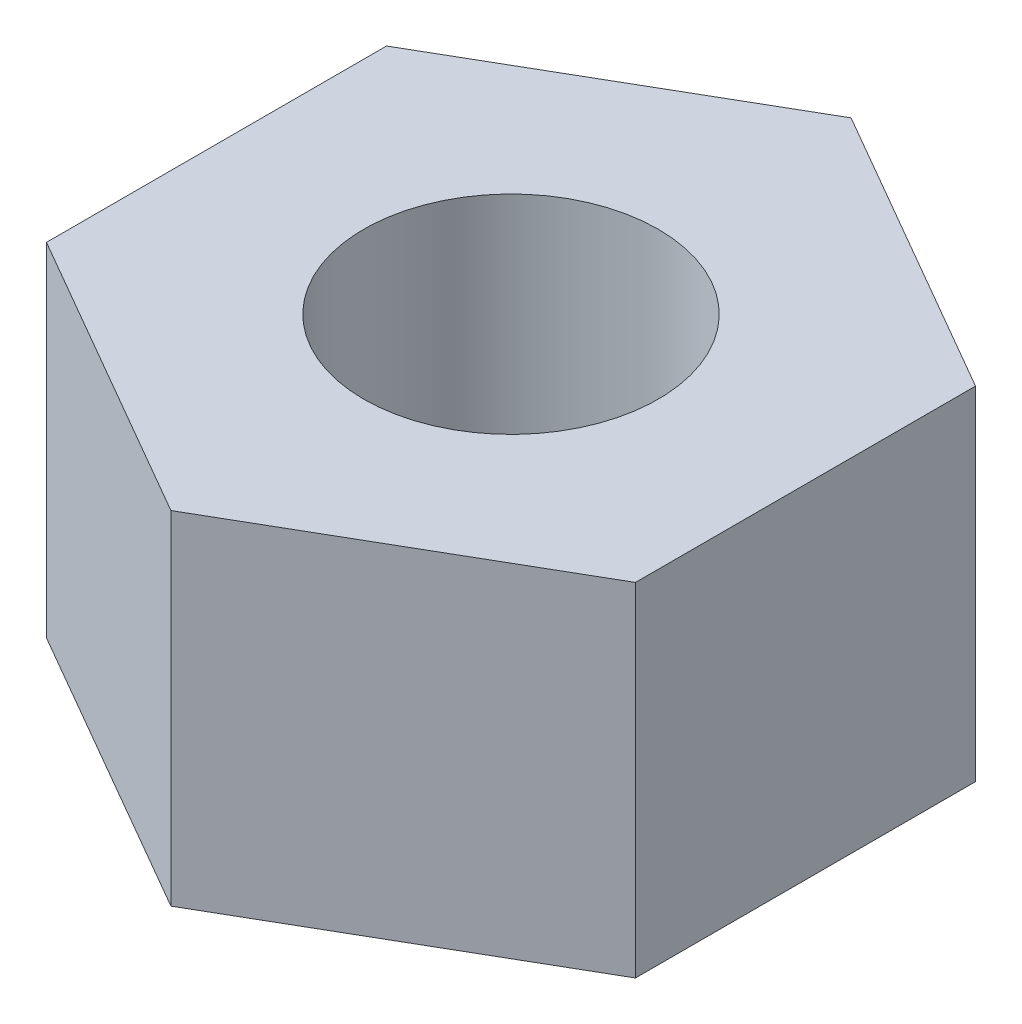
ISO-10303-21;
HEADER;
FILE_DESCRIPTION(('STEP AP214'),'2;1');
FILE_NAME('part.step','',(''),(''),'','','');
FILE_SCHEMA(('AUTOMOTIVE_DESIGN { 1 0 10303 214 1 1 1 1 }'));
ENDSEC;
DATA;
#1=APPLICATION_CONTEXT('core data for automotive mechanical design processes');
#2=APPLICATION_PROTOCOL_DEFINITION('international standard','automotive_design',2000,#1);
#3=PRODUCT_CONTEXT('',#1,'mechanical');
#4=PRODUCT('Part','Part','',(#3));
#5=PRODUCT_RELATED_PRODUCT_CATEGORY('part','',(#4));
#6=PRODUCT_DEFINITION_FORMATION('','',#4);
#7=PRODUCT_DEFINITION_CONTEXT('part definition',#1,'design');
#8=PRODUCT_DEFINITION('design','',#6,#7);
#9=PRODUCT_DEFINITION_SHAPE('','',#8);
#10=(LENGTH_UNIT() NAMED_UNIT(*) SI_UNIT(.MILLI.,.METRE.));
#11=(NAMED_UNIT(*) PLANE_ANGLE_UNIT() SI_UNIT($,.RADIAN.));
#12=(NAMED_UNIT(*) SI_UNIT($,.STERADIAN.) SOLID_ANGLE_UNIT());
#13=UNCERTAINTY_MEASURE_WITH_UNIT(LENGTH_MEASURE(1.E-05),#10,'distance_accuracy_value','');
#14=(GEOMETRIC_REPRESENTATION_CONTEXT(3) GLOBAL_UNCERTAINTY_ASSIGNED_CONTEXT((#13)) GLOBAL_UNIT_ASSIGNED_CONTEXT((#10,
#11,#12)) REPRESENTATION_CONTEXT('',''));
#15=CARTESIAN_POINT('',(0.,0.,0.));
#16=DIRECTION('',(0.,0.,1.));
#17=DIRECTION('',(1.,0.,0.));
#18=AXIS2_PLACEMENT_3D('',#15,#16,#17);
#19=CARTESIAN_POINT('',(0.,2.28,0.));
#20=DIRECTION('',(0.,1.,0.));
#21=DIRECTION('',(0.,0.,1.));
#22=AXIS2_PLACEMENT_3D('',#19,#20,#21);
#23=PLANE('',#22);
#24=DIRECTION('',(0.866025403784438,0.,0.5));
#25=VECTOR('',#24,1.);
#26=CARTESIAN_POINT('',(-1.96,2.28,1.13160652761167));
#27=LINE('',#26,#25);
#28=CARTESIAN_POINT('',(-1.96,2.28,1.13160652761167));
#29=VERTEX_POINT('',#28);
#30=CARTESIAN_POINT('',(0.,2.28,2.26321305522333));
#31=VERTEX_POINT('',#30);
#32=EDGE_CURVE('E130',#29,#31,#27,.T.);
#33=ORIENTED_EDGE('',*,*,#32,.T.);
#34=DIRECTION('',(0.866025403784438,0.,-0.5));
#35=VECTOR('',#34,1.);
#36=CARTESIAN_POINT('',(0.,2.28,2.26321305522333));
#37=LINE('',#36,#35);
#38=CARTESIAN_POINT('',(1.96,2.28,1.13160652761167));
#39=VERTEX_POINT('',#38);
#40=EDGE_CURVE('E88',#31,#39,#37,.T.);
#41=ORIENTED_EDGE('',*,*,#40,.T.);
#42=DIRECTION('',(0.,0.,-1.));
#43=VECTOR('',#42,1.);
#44=CARTESIAN_POINT('',(1.96,2.28,1.13160652761167));
#45=LINE('',#44,#43);
#46=CARTESIAN_POINT('',(1.96,2.28,-1.13160652761167));
#47=VERTEX_POINT('',#46);
#48=EDGE_CURVE('E101',#39,#47,#45,.T.);
#49=ORIENTED_EDGE('',*,*,#48,.T.);
#50=DIRECTION('',(-0.866025403784439,0.,-0.5));
#51=VECTOR('',#50,1.);
#52=CARTESIAN_POINT('',(1.96,2.28,-1.13160652761167));
#53=LINE('',#52,#51);
#54=CARTESIAN_POINT('',(0.,2.28,-2.26321305522333));
#55=VERTEX_POINT('',#54);
#56=EDGE_CURVE('E95',#47,#55,#53,.T.);
#57=ORIENTED_EDGE('',*,*,#56,.T.);
#58=DIRECTION('',(-0.866025403784439,0.,0.5));
#59=VECTOR('',#58,1.);
#60=CARTESIAN_POINT('',(0.,2.28,-2.26321305522333));
#61=LINE('',#60,#59);
#62=CARTESIAN_POINT('',(-1.96,2.28,-1.13160652761167));
#63=VERTEX_POINT('',#62);
#64=EDGE_CURVE('E99',#55,#63,#61,.T.);
#65=ORIENTED_EDGE('',*,*,#64,.T.);
#66=DIRECTION('',(0.,0.,1.));
#67=VECTOR('',#66,1.);
#68=CARTESIAN_POINT('',(-1.96,2.28,-1.13160652761167));
#69=LINE('',#68,#67);
#70=EDGE_CURVE('E51',#63,#29,#69,.T.);
#71=ORIENTED_EDGE('',*,*,#70,.T.);
#72=EDGE_LOOP('',(#33,#41,#49,#57,#65,#71));
#73=FACE_BOUND('',#72,.T.);
#74=CARTESIAN_POINT('',(0.,2.28,0.));
#75=DIRECTION('',(0.,1.,0.));
#76=DIRECTION('',(0.,0.,1.));
#77=AXIS2_PLACEMENT_3D('',#74,#75,#76);
#78=CIRCLE('',#77,0.98);
#79=CARTESIAN_POINT('',(0.,2.28,0.98));
#80=VERTEX_POINT('',#79);
#81=EDGE_CURVE('E123',#80,#80,#78,.T.);
#82=ORIENTED_EDGE('',*,*,#81,.F.);
#83=EDGE_LOOP('',(#82));
#84=FACE_BOUND('',#83,.T.);
#85=ADVANCED_FACE('F34',(#73,#84),#23,.T.);
#86=CARTESIAN_POINT('',(0.,0.,0.));
#87=DIRECTION('',(0.,1.,0.));
#88=DIRECTION('',(0.,0.,1.));
#89=AXIS2_PLACEMENT_3D('',#86,#87,#88);
#90=PLANE('',#89);
#91=DIRECTION('',(0.866025403784438,0.,0.5));
#92=VECTOR('',#91,1.);
#93=CARTESIAN_POINT('',(-1.96,0.,1.13160652761167));
#94=LINE('',#93,#92);
#95=CARTESIAN_POINT('',(-1.96,0.,1.13160652761167));
#96=VERTEX_POINT('',#95);
#97=CARTESIAN_POINT('',(0.,0.,2.26321305522333));
#98=VERTEX_POINT('',#97);
#99=EDGE_CURVE('E119',#96,#98,#94,.T.);
#100=ORIENTED_EDGE('',*,*,#99,.F.);
#101=DIRECTION('',(0.,0.,1.));
#102=VECTOR('',#101,1.);
#103=CARTESIAN_POINT('',(-1.96,0.,-1.13160652761167));
#104=LINE('',#103,#102);
#105=CARTESIAN_POINT('',(-1.96,0.,-1.13160652761167));
#106=VERTEX_POINT('',#105);
#107=EDGE_CURVE('E80',#106,#96,#104,.T.);
#108=ORIENTED_EDGE('',*,*,#107,.F.);
#109=DIRECTION('',(-0.866025403784439,0.,0.5));
#110=VECTOR('',#109,1.);
#111=CARTESIAN_POINT('',(0.,0.,-2.26321305522333));
#112=LINE('',#111,#110);
#113=CARTESIAN_POINT('',(0.,0.,-2.26321305522333));
#114=VERTEX_POINT('',#113);
#115=EDGE_CURVE('E74',#114,#106,#112,.T.);
#116=ORIENTED_EDGE('',*,*,#115,.F.);
#117=DIRECTION('',(-0.866025403784439,0.,-0.5));
#118=VECTOR('',#117,1.);
#119=CARTESIAN_POINT('',(1.96,0.,-1.13160652761167));
#120=LINE('',#119,#118);
#121=CARTESIAN_POINT('',(1.96,0.,-1.13160652761167));
#122=VERTEX_POINT('',#121);
#123=EDGE_CURVE('E109',#122,#114,#120,.T.);
#124=ORIENTED_EDGE('',*,*,#123,.F.);
#125=DIRECTION('',(0.,0.,-1.));
#126=VECTOR('',#125,1.);
#127=CARTESIAN_POINT('',(1.96,0.,1.13160652761167));
#128=LINE('',#127,#126);
#129=CARTESIAN_POINT('',(1.96,0.,1.13160652761167));
#130=VERTEX_POINT('',#129);
#131=EDGE_CURVE('E125',#130,#122,#128,.T.);
#132=ORIENTED_EDGE('',*,*,#131,.F.);
#133=DIRECTION('',(0.866025403784438,0.,-0.5));
#134=VECTOR('',#133,1.);
#135=CARTESIAN_POINT('',(0.,0.,2.26321305522333));
#136=LINE('',#135,#134);
#137=EDGE_CURVE('E122',#98,#130,#136,.T.);
#138=ORIENTED_EDGE('',*,*,#137,.F.);
#139=EDGE_LOOP('',(#100,#108,#116,#124,#132,#138));
#140=FACE_BOUND('',#139,.T.);
#141=CARTESIAN_POINT('',(0.,0.,0.));
#142=DIRECTION('',(0.,1.,0.));
#143=DIRECTION('',(0.,0.,1.));
#144=AXIS2_PLACEMENT_3D('',#141,#142,#143);
#145=CIRCLE('',#144,0.98);
#146=CARTESIAN_POINT('',(0.,0.,0.98));
#147=VERTEX_POINT('',#146);
#148=EDGE_CURVE('E223',#147,#147,#145,.T.);
#149=ORIENTED_EDGE('',*,*,#148,.T.);
#150=EDGE_LOOP('',(#149));
#151=FACE_BOUND('',#150,.T.);
#152=ADVANCED_FACE('F139',(#140,#151),#90,.F.);
#153=CARTESIAN_POINT('',(-1.96,2.28,1.13160652761167));
#154=DIRECTION('',(0.5,0.,-0.866025403784438));
#155=DIRECTION('',(-0.866025403784439,0.,-0.5));
#156=AXIS2_PLACEMENT_3D('',#153,#154,#155);
#157=PLANE('',#156);
#158=ORIENTED_EDGE('',*,*,#99,.T.);
#159=DIRECTION('',(0.,-1.,0.));
#160=VECTOR('',#159,1.);
#161=CARTESIAN_POINT('',(0.,2.28,2.26321305522333));
#162=LINE('',#161,#160);
#163=EDGE_CURVE('E11',#31,#98,#162,.T.);
#164=ORIENTED_EDGE('',*,*,#163,.F.);
#165=ORIENTED_EDGE('',*,*,#32,.F.);
#166=DIRECTION('',(0.,-1.,0.));
#167=VECTOR('',#166,1.);
#168=CARTESIAN_POINT('',(-1.96,2.28,1.13160652761167));
#169=LINE('',#168,#167);
#170=EDGE_CURVE('E115',#29,#96,#169,.T.);
#171=ORIENTED_EDGE('',*,*,#170,.T.);
#172=EDGE_LOOP('',(#158,#164,#165,#171));
#173=FACE_BOUND('',#172,.T.);
#174=ADVANCED_FACE('F36',(#173),#157,.F.);
#175=CARTESIAN_POINT('',(0.,2.28,2.26321305522333));
#176=DIRECTION('',(-0.5,0.,-0.866025403784438));
#177=DIRECTION('',(-0.866025403784439,0.,0.5));
#178=AXIS2_PLACEMENT_3D('',#175,#176,#177);
#179=PLANE('',#178);
#180=ORIENTED_EDGE('',*,*,#137,.T.);
#181=DIRECTION('',(0.,-1.,0.));
#182=VECTOR('',#181,1.);
#183=CARTESIAN_POINT('',(1.96,2.28,1.13160652761167));
#184=LINE('',#183,#182);
#185=EDGE_CURVE('E43',#39,#130,#184,.T.);
#186=ORIENTED_EDGE('',*,*,#185,.F.);
#187=ORIENTED_EDGE('',*,*,#40,.F.);
#188=ORIENTED_EDGE('',*,*,#163,.T.);
#189=EDGE_LOOP('',(#180,#186,#187,#188));
#190=FACE_BOUND('',#189,.T.);
#191=ADVANCED_FACE('F164',(#190),#179,.F.);
#192=CARTESIAN_POINT('',(1.96,2.28,1.13160652761167));
#193=DIRECTION('',(-1.,0.,0.));
#194=DIRECTION('',(0.,0.,1.));
#195=AXIS2_PLACEMENT_3D('',#192,#193,#194);
#196=PLANE('',#195);
#197=ORIENTED_EDGE('',*,*,#131,.T.);
#198=DIRECTION('',(0.,-1.,0.));
#199=VECTOR('',#198,1.);
#200=CARTESIAN_POINT('',(1.96,2.28,-1.13160652761167));
#201=LINE('',#200,#199);
#202=EDGE_CURVE('E110',#47,#122,#201,.T.);
#203=ORIENTED_EDGE('',*,*,#202,.F.);
#204=ORIENTED_EDGE('',*,*,#48,.F.);
#205=ORIENTED_EDGE('',*,*,#185,.T.);
#206=EDGE_LOOP('',(#197,#203,#204,#205));
#207=FACE_BOUND('',#206,.T.);
#208=ADVANCED_FACE('F136',(#207),#196,.F.);
#209=CARTESIAN_POINT('',(1.96,2.28,-1.13160652761167));
#210=DIRECTION('',(-0.5,0.,0.866025403784439));
#211=DIRECTION('',(0.866025403784439,0.,0.5));
#212=AXIS2_PLACEMENT_3D('',#209,#210,#211);
#213=PLANE('',#212);
#214=ORIENTED_EDGE('',*,*,#123,.T.);
#215=DIRECTION('',(0.,-1.,0.));
#216=VECTOR('',#215,1.);
#217=CARTESIAN_POINT('',(0.,2.28,-2.26321305522333));
#218=LINE('',#217,#216);
#219=EDGE_CURVE('E106',#55,#114,#218,.T.);
#220=ORIENTED_EDGE('',*,*,#219,.F.);
#221=ORIENTED_EDGE('',*,*,#56,.F.);
#222=ORIENTED_EDGE('',*,*,#202,.T.);
#223=EDGE_LOOP('',(#214,#220,#221,#222));
#224=FACE_BOUND('',#223,.T.);
#225=ADVANCED_FACE('F107',(#224),#213,.F.);
#226=CARTESIAN_POINT('',(0.,2.28,-2.26321305522333));
#227=DIRECTION('',(0.5,0.,0.866025403784439));
#228=DIRECTION('',(0.866025403784439,0.,-0.5));
#229=AXIS2_PLACEMENT_3D('',#226,#227,#228);
#230=PLANE('',#229);
#231=ORIENTED_EDGE('',*,*,#115,.T.);
#232=DIRECTION('',(0.,-1.,0.));
#233=VECTOR('',#232,1.);
#234=CARTESIAN_POINT('',(-1.96,2.28,-1.13160652761167));
#235=LINE('',#234,#233);
#236=EDGE_CURVE('E111',#63,#106,#235,.T.);
#237=ORIENTED_EDGE('',*,*,#236,.F.);
#238=ORIENTED_EDGE('',*,*,#64,.F.);
#239=ORIENTED_EDGE('',*,*,#219,.T.);
#240=EDGE_LOOP('',(#231,#237,#238,#239));
#241=FACE_BOUND('',#240,.T.);
#242=ADVANCED_FACE('F113',(#241),#230,.F.);
#243=CARTESIAN_POINT('',(-1.96,2.28,-1.13160652761167));
#244=DIRECTION('',(1.,0.,0.));
#245=DIRECTION('',(0.,0.,-1.));
#246=AXIS2_PLACEMENT_3D('',#243,#244,#245);
#247=PLANE('',#246);
#248=ORIENTED_EDGE('',*,*,#107,.T.);
#249=ORIENTED_EDGE('',*,*,#170,.F.);
#250=ORIENTED_EDGE('',*,*,#70,.F.);
#251=ORIENTED_EDGE('',*,*,#236,.T.);
#252=EDGE_LOOP('',(#248,#249,#250,#251));
#253=FACE_BOUND('',#252,.T.);
#254=ADVANCED_FACE('F144',(#253),#247,.F.);
#255=CARTESIAN_POINT('',(0.,2.28,0.));
#256=DIRECTION('',(0.,-1.,0.));
#257=DIRECTION('',(0.,0.,-1.));
#258=AXIS2_PLACEMENT_3D('',#255,#256,#257);
#259=CYLINDRICAL_SURFACE('',#258,0.98);
#260=ORIENTED_EDGE('',*,*,#81,.T.);
#261=EDGE_LOOP('',(#260));
#262=FACE_BOUND('',#261,.T.);
#263=ORIENTED_EDGE('',*,*,#148,.F.);
#264=EDGE_LOOP('',(#263));
#265=FACE_BOUND('',#264,.T.);
#266=ADVANCED_FACE('F146',(#262,#265),#259,.F.);
#267=CLOSED_SHELL('',(#85,#152,#174,#191,#208,#225,#242,#254,#266));
#268=MANIFOLD_SOLID_BREP('B2',#267);
#269=ADVANCED_BREP_SHAPE_REPRESENTATION('',(#18,#268),#14);
#270=SHAPE_DEFINITION_REPRESENTATION(#9,#269);
ENDSEC;
END-ISO-10303-21;
